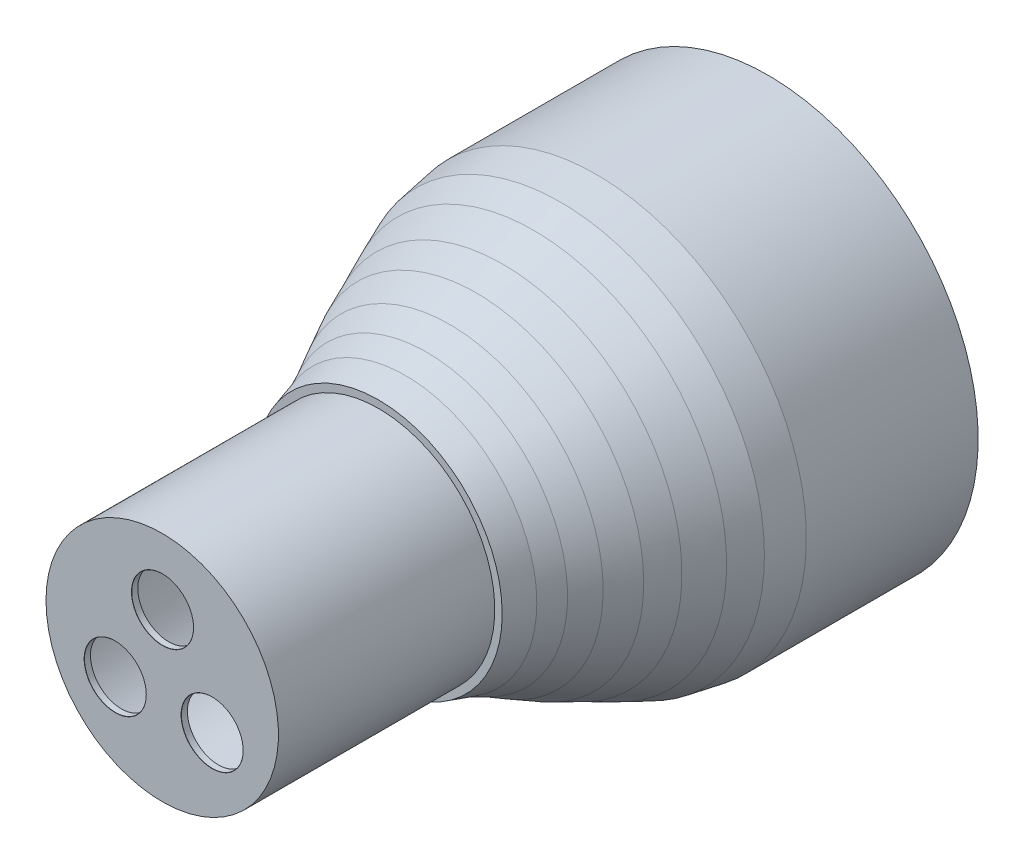
ISO-10303-21;
HEADER;
FILE_DESCRIPTION(('STEP AP214'),'2;1');
FILE_NAME('part.step','',(''),(''),'','','');
FILE_SCHEMA(('AUTOMOTIVE_DESIGN { 1 0 10303 214 1 1 1 1 }'));
ENDSEC;
DATA;
#1=APPLICATION_CONTEXT('core data for automotive mechanical design processes');
#2=APPLICATION_PROTOCOL_DEFINITION('international standard','automotive_design',2000,#1);
#3=PRODUCT_CONTEXT('',#1,'mechanical');
#4=PRODUCT('Part','Part','',(#3));
#5=PRODUCT_RELATED_PRODUCT_CATEGORY('part','',(#4));
#6=PRODUCT_DEFINITION_FORMATION('','',#4);
#7=PRODUCT_DEFINITION_CONTEXT('part definition',#1,'design');
#8=PRODUCT_DEFINITION('design','',#6,#7);
#9=PRODUCT_DEFINITION_SHAPE('','',#8);
#10=(LENGTH_UNIT() NAMED_UNIT(*) SI_UNIT(.MILLI.,.METRE.));
#11=(NAMED_UNIT(*) PLANE_ANGLE_UNIT() SI_UNIT($,.RADIAN.));
#12=(NAMED_UNIT(*) SI_UNIT($,.STERADIAN.) SOLID_ANGLE_UNIT());
#13=UNCERTAINTY_MEASURE_WITH_UNIT(LENGTH_MEASURE(1.E-05),#10,'distance_accuracy_value','');
#14=(GEOMETRIC_REPRESENTATION_CONTEXT(3) GLOBAL_UNCERTAINTY_ASSIGNED_CONTEXT((#13)) GLOBAL_UNIT_ASSIGNED_CONTEXT((#10,
#11,#12)) REPRESENTATION_CONTEXT('',''));
#15=CARTESIAN_POINT('',(0.,0.,0.));
#16=DIRECTION('',(0.,0.,1.));
#17=DIRECTION('',(1.,0.,0.));
#18=AXIS2_PLACEMENT_3D('',#15,#16,#17);
#19=CARTESIAN_POINT('',(-8.66903428879138,0.,-16.));
#20=DIRECTION('',(0.,0.,-1.));
#21=DIRECTION('',(-1.,0.,0.));
#22=AXIS2_PLACEMENT_3D('',#19,#20,#21);
#23=CYLINDRICAL_SURFACE('',#22,17.8);
#24=CARTESIAN_POINT('',(-8.66903428879138,0.,-50.));
#25=DIRECTION('',(0.,0.,-1.));
#26=DIRECTION('',(-1.,0.,0.));
#27=AXIS2_PLACEMENT_3D('',#24,#25,#26);
#28=CIRCLE('',#27,17.8);
#29=CARTESIAN_POINT('',(-26.4690342887914,0.,-50.));
#30=VERTEX_POINT('',#29);
#31=EDGE_CURVE('E10',#30,#30,#28,.T.);
#32=ORIENTED_EDGE('',*,*,#31,.T.);
#33=EDGE_LOOP('',(#32));
#34=FACE_BOUND('',#33,.T.);
#35=CARTESIAN_POINT('',(-8.66903428879138,0.,-16.));
#36=DIRECTION('',(0.,0.,-1.));
#37=DIRECTION('',(-1.,0.,0.));
#38=AXIS2_PLACEMENT_3D('',#35,#36,#37);
#39=CIRCLE('',#38,17.8);
#40=CARTESIAN_POINT('',(-26.4690342887914,0.,-16.));
#41=VERTEX_POINT('',#40);
#42=EDGE_CURVE('E52',#41,#41,#39,.T.);
#43=ORIENTED_EDGE('',*,*,#42,.F.);
#44=EDGE_LOOP('',(#43));
#45=FACE_BOUND('',#44,.T.);
#46=ADVANCED_FACE('F34',(#34,#45),#23,.F.);
#47=CARTESIAN_POINT('',(-8.66903428879138,0.,-50.));
#48=DIRECTION('',(0.,0.,-1.));
#49=DIRECTION('',(-1.,0.,0.));
#50=AXIS2_PLACEMENT_3D('',#47,#48,#49);
#51=CONICAL_SURFACE('',#50,17.8,0.157762707712365);
#52=CARTESIAN_POINT('',(-8.66903428879138,0.,-53.9341050667215));
#53=DIRECTION('',(0.,0.,-1.));
#54=DIRECTION('',(-1.,0.,0.));
#55=AXIS2_PLACEMENT_3D('',#52,#53,#54);
#56=CIRCLE('',#55,18.4258560289448);
#57=CARTESIAN_POINT('',(-27.0948903177362,0.,-53.9341050667215));
#58=VERTEX_POINT('',#57);
#59=EDGE_CURVE('E41',#58,#58,#56,.T.);
#60=ORIENTED_EDGE('',*,*,#59,.T.);
#61=EDGE_LOOP('',(#60));
#62=FACE_BOUND('',#61,.T.);
#63=ORIENTED_EDGE('',*,*,#31,.F.);
#64=EDGE_LOOP('',(#63));
#65=FACE_BOUND('',#64,.T.);
#66=ADVANCED_FACE('F140',(#62,#65),#51,.F.);
#67=CARTESIAN_POINT('',(-8.66903428879138,0.,-53.9341050667215));
#68=DIRECTION('',(0.,0.,-1.));
#69=DIRECTION('',(-1.,0.,0.));
#70=AXIS2_PLACEMENT_3D('',#67,#68,#69);
#71=CONICAL_SURFACE('',#70,18.4258560289448,0.484477929037022);
#72=CARTESIAN_POINT('',(-8.66903428879138,0.,-59.3263719334045));
#73=DIRECTION('',(0.,0.,-1.));
#74=DIRECTION('',(-1.,0.,0.));
#75=AXIS2_PLACEMENT_3D('',#72,#73,#74);
#76=CIRCLE('',#75,21.2638912219359);
#77=CARTESIAN_POINT('',(-29.9329255107273,0.,-59.3263719334045));
#78=VERTEX_POINT('',#77);
#79=EDGE_CURVE('E46',#78,#78,#76,.T.);
#80=ORIENTED_EDGE('',*,*,#79,.T.);
#81=EDGE_LOOP('',(#80));
#82=FACE_BOUND('',#81,.T.);
#83=ORIENTED_EDGE('',*,*,#59,.F.);
#84=EDGE_LOOP('',(#83));
#85=FACE_BOUND('',#84,.T.);
#86=ADVANCED_FACE('F125',(#82,#85),#71,.F.);
#87=CARTESIAN_POINT('',(-8.66903428879138,0.,-59.3263719334045));
#88=DIRECTION('',(0.,0.,-1.));
#89=DIRECTION('',(-1.,0.,0.));
#90=AXIS2_PLACEMENT_3D('',#87,#88,#89);
#91=CONICAL_SURFACE('',#90,21.2638912219359,0.568594158356578);
#92=CARTESIAN_POINT('',(-8.66903428879138,0.,-65.8116474496894));
#93=DIRECTION('',(0.,0.,-1.));
#94=DIRECTION('',(-1.,0.,0.));
#95=AXIS2_PLACEMENT_3D('',#92,#93,#94);
#96=CIRCLE('',#95,25.4078974330345);
#97=CARTESIAN_POINT('',(-34.0769317218259,0.,-65.8116474496894));
#98=VERTEX_POINT('',#97);
#99=EDGE_CURVE('E120',#98,#98,#96,.T.);
#100=ORIENTED_EDGE('',*,*,#99,.T.);
#101=EDGE_LOOP('',(#100));
#102=FACE_BOUND('',#101,.T.);
#103=ORIENTED_EDGE('',*,*,#79,.F.);
#104=EDGE_LOOP('',(#103));
#105=FACE_BOUND('',#104,.T.);
#106=ADVANCED_FACE('F128',(#102,#105),#91,.F.);
#107=CARTESIAN_POINT('',(-8.66903428879138,0.,-65.8116474496894));
#108=DIRECTION('',(0.,0.,-1.));
#109=DIRECTION('',(-1.,0.,0.));
#110=AXIS2_PLACEMENT_3D('',#107,#108,#109);
#111=CONICAL_SURFACE('',#110,25.4078974330345,0.414658083621896);
#112=CARTESIAN_POINT('',(-8.66903428879138,0.,-77.8398126003887));
#113=DIRECTION('',(0.,0.,-1.));
#114=DIRECTION('',(-1.,0.,0.));
#115=AXIS2_PLACEMENT_3D('',#112,#113,#114);
#116=CIRCLE('',#115,30.7024611244156);
#117=CARTESIAN_POINT('',(-39.371495413207,0.,-77.8398126003887));
#118=VERTEX_POINT('',#117);
#119=EDGE_CURVE('E117',#118,#118,#116,.T.);
#120=ORIENTED_EDGE('',*,*,#119,.T.);
#121=EDGE_LOOP('',(#120));
#122=FACE_BOUND('',#121,.T.);
#123=ORIENTED_EDGE('',*,*,#99,.F.);
#124=EDGE_LOOP('',(#123));
#125=FACE_BOUND('',#124,.T.);
#126=ADVANCED_FACE('F130',(#122,#125),#111,.F.);
#127=CARTESIAN_POINT('',(-8.66903428879138,0.,-77.8398126003887));
#128=DIRECTION('',(0.,0.,-1.));
#129=DIRECTION('',(-1.,0.,0.));
#130=AXIS2_PLACEMENT_3D('',#127,#128,#129);
#131=CONICAL_SURFACE('',#130,30.7024611244156,0.150406298673594);
#132=CARTESIAN_POINT('',(-8.66903428879138,0.,-93.));
#133=DIRECTION('',(0.,0.,-1.));
#134=DIRECTION('',(-1.,0.,0.));
#135=AXIS2_PLACEMENT_3D('',#132,#133,#134);
#136=CIRCLE('',#135,33.);
#137=CARTESIAN_POINT('',(-41.6690342887914,0.,-93.));
#138=VERTEX_POINT('',#137);
#139=EDGE_CURVE('E114',#138,#138,#136,.T.);
#140=ORIENTED_EDGE('',*,*,#139,.T.);
#141=EDGE_LOOP('',(#140));
#142=FACE_BOUND('',#141,.T.);
#143=ORIENTED_EDGE('',*,*,#119,.F.);
#144=EDGE_LOOP('',(#143));
#145=FACE_BOUND('',#144,.T.);
#146=ADVANCED_FACE('F137',(#142,#145),#131,.F.);
#147=CARTESIAN_POINT('',(-8.66903428879138,0.,-16.));
#148=DIRECTION('',(0.,0.,-1.));
#149=DIRECTION('',(-1.,0.,0.));
#150=AXIS2_PLACEMENT_3D('',#147,#148,#149);
#151=CYLINDRICAL_SURFACE('',#150,33.);
#152=CARTESIAN_POINT('',(-8.66903428879138,0.,-113.));
#153=DIRECTION('',(0.,0.,-1.));
#154=DIRECTION('',(-1.,0.,0.));
#155=AXIS2_PLACEMENT_3D('',#152,#153,#154);
#156=CIRCLE('',#155,33.);
#157=CARTESIAN_POINT('',(-41.6690342887914,0.,-113.));
#158=VERTEX_POINT('',#157);
#159=EDGE_CURVE('E111',#158,#158,#156,.T.);
#160=ORIENTED_EDGE('',*,*,#159,.T.);
#161=EDGE_LOOP('',(#160));
#162=FACE_BOUND('',#161,.T.);
#163=ORIENTED_EDGE('',*,*,#139,.F.);
#164=EDGE_LOOP('',(#163));
#165=FACE_BOUND('',#164,.T.);
#166=ADVANCED_FACE('F216',(#162,#165),#151,.F.);
#167=CARTESIAN_POINT('',(-42.6690342887914,0.,-113.));
#168=DIRECTION('',(0.,0.,-1.));
#169=DIRECTION('',(-1.,0.,0.));
#170=AXIS2_PLACEMENT_3D('',#167,#168,#169);
#171=PLANE('',#170);
#172=CARTESIAN_POINT('',(-8.66903428879138,0.,-113.));
#173=DIRECTION('',(0.,0.,-1.));
#174=DIRECTION('',(-1.,0.,0.));
#175=AXIS2_PLACEMENT_3D('',#172,#173,#174);
#176=CIRCLE('',#175,34.);
#177=CARTESIAN_POINT('',(-42.6690342887914,0.,-113.));
#178=VERTEX_POINT('',#177);
#179=EDGE_CURVE('E108',#178,#178,#176,.T.);
#180=ORIENTED_EDGE('',*,*,#179,.T.);
#181=EDGE_LOOP('',(#180));
#182=FACE_BOUND('',#181,.T.);
#183=ORIENTED_EDGE('',*,*,#159,.F.);
#184=EDGE_LOOP('',(#183));
#185=FACE_BOUND('',#184,.T.);
#186=ADVANCED_FACE('F212',(#182,#185),#171,.T.);
#187=CARTESIAN_POINT('',(-8.66903428879138,0.,-16.));
#188=DIRECTION('',(0.,0.,-1.));
#189=DIRECTION('',(-1.,0.,0.));
#190=AXIS2_PLACEMENT_3D('',#187,#188,#189);
#191=CYLINDRICAL_SURFACE('',#190,34.);
#192=CARTESIAN_POINT('',(-8.66903428879138,0.,-85.2088551823281));
#193=DIRECTION('',(0.,0.,-1.));
#194=DIRECTION('',(-1.,0.,0.));
#195=AXIS2_PLACEMENT_3D('',#192,#193,#194);
#196=CIRCLE('',#195,34.);
#197=CARTESIAN_POINT('',(-42.6690342887914,0.,-85.2088551823281));
#198=VERTEX_POINT('',#197);
#199=EDGE_CURVE('E105',#198,#198,#196,.T.);
#200=ORIENTED_EDGE('',*,*,#199,.T.);
#201=EDGE_LOOP('',(#200));
#202=FACE_BOUND('',#201,.T.);
#203=ORIENTED_EDGE('',*,*,#179,.F.);
#204=EDGE_LOOP('',(#203));
#205=FACE_BOUND('',#204,.T.);
#206=ADVANCED_FACE('F208',(#202,#205),#191,.T.);
#207=CARTESIAN_POINT('',(-8.66903428879138,0.,-85.2088551823281));
#208=DIRECTION('',(0.,0.,-1.));
#209=DIRECTION('',(-1.,0.,0.));
#210=AXIS2_PLACEMENT_3D('',#207,#208,#209);
#211=CONICAL_SURFACE('',#210,34.,0.171133999776557);
#212=CARTESIAN_POINT('',(-8.66903428879138,0.,-79.4226373320863));
#213=DIRECTION('',(0.,0.,-1.));
#214=DIRECTION('',(-1.,0.,0.));
#215=AXIS2_PLACEMENT_3D('',#212,#213,#214);
#216=CIRCLE('',#215,33.);
#217=CARTESIAN_POINT('',(-41.6690342887914,0.,-79.4226373320863));
#218=VERTEX_POINT('',#217);
#219=EDGE_CURVE('E102',#218,#218,#216,.T.);
#220=ORIENTED_EDGE('',*,*,#219,.T.);
#221=EDGE_LOOP('',(#220));
#222=FACE_BOUND('',#221,.T.);
#223=ORIENTED_EDGE('',*,*,#199,.F.);
#224=EDGE_LOOP('',(#223));
#225=FACE_BOUND('',#224,.T.);
#226=ADVANCED_FACE('F204',(#222,#225),#211,.T.);
#227=CARTESIAN_POINT('',(-8.66903428879138,0.,-79.4226373320863));
#228=DIRECTION('',(0.,0.,-1.));
#229=DIRECTION('',(-1.,0.,0.));
#230=AXIS2_PLACEMENT_3D('',#227,#228,#229);
#231=CONICAL_SURFACE('',#230,33.,0.397305922526933);
#232=CARTESIAN_POINT('',(-8.66903428879138,0.,-75.1171781672985));
#233=DIRECTION('',(0.,0.,-1.));
#234=DIRECTION('',(-1.,0.,0.));
#235=AXIS2_PLACEMENT_3D('',#232,#233,#234);
#236=CIRCLE('',#235,31.1933381910491);
#237=CARTESIAN_POINT('',(-39.8623724798404,0.,-75.1171781672985));
#238=VERTEX_POINT('',#237);
#239=EDGE_CURVE('E99',#238,#238,#236,.T.);
#240=ORIENTED_EDGE('',*,*,#239,.T.);
#241=EDGE_LOOP('',(#240));
#242=FACE_BOUND('',#241,.T.);
#243=ORIENTED_EDGE('',*,*,#219,.F.);
#244=EDGE_LOOP('',(#243));
#245=FACE_BOUND('',#244,.T.);
#246=ADVANCED_FACE('F200',(#242,#245),#231,.T.);
#247=CARTESIAN_POINT('',(-8.66903428879138,0.,-75.1171781672985));
#248=DIRECTION('',(0.,0.,-1.));
#249=DIRECTION('',(-1.,0.,0.));
#250=AXIS2_PLACEMENT_3D('',#247,#248,#249);
#251=CONICAL_SURFACE('',#250,31.1933381910491,0.422165715006541);
#252=CARTESIAN_POINT('',(-8.66903428879138,0.,-70.1224722289791));
#253=DIRECTION('',(0.,0.,-1.));
#254=DIRECTION('',(-1.,0.,0.));
#255=AXIS2_PLACEMENT_3D('',#252,#253,#254);
#256=CIRCLE('',#255,28.9498527279035);
#257=CARTESIAN_POINT('',(-37.6188870166949,0.,-70.1224722289791));
#258=VERTEX_POINT('',#257);
#259=EDGE_CURVE('E96',#258,#258,#256,.T.);
#260=ORIENTED_EDGE('',*,*,#259,.T.);
#261=EDGE_LOOP('',(#260));
#262=FACE_BOUND('',#261,.T.);
#263=ORIENTED_EDGE('',*,*,#239,.F.);
#264=EDGE_LOOP('',(#263));
#265=FACE_BOUND('',#264,.T.);
#266=ADVANCED_FACE('F196',(#262,#265),#251,.T.);
#267=CARTESIAN_POINT('',(-8.66903428879138,0.,-70.1224722289791));
#268=DIRECTION('',(0.,0.,-1.));
#269=DIRECTION('',(-1.,0.,0.));
#270=AXIS2_PLACEMENT_3D('',#267,#268,#269);
#271=CONICAL_SURFACE('',#270,28.9498527279035,0.408611682684209);
#272=CARTESIAN_POINT('',(-8.66903428879138,0.,-65.8116474496894));
#273=DIRECTION('',(0.,0.,-1.));
#274=DIRECTION('',(-1.,0.,0.));
#275=AXIS2_PLACEMENT_3D('',#272,#273,#274);
#276=CIRCLE('',#275,27.0833448206381);
#277=CARTESIAN_POINT('',(-35.7523791094295,0.,-65.8116474496894));
#278=VERTEX_POINT('',#277);
#279=EDGE_CURVE('E93',#278,#278,#276,.T.);
#280=ORIENTED_EDGE('',*,*,#279,.T.);
#281=EDGE_LOOP('',(#280));
#282=FACE_BOUND('',#281,.T.);
#283=ORIENTED_EDGE('',*,*,#259,.F.);
#284=EDGE_LOOP('',(#283));
#285=FACE_BOUND('',#284,.T.);
#286=ADVANCED_FACE('F192',(#282,#285),#271,.T.);
#287=CARTESIAN_POINT('',(-8.66903428879138,0.,-65.8116474496894));
#288=DIRECTION('',(0.,0.,-1.));
#289=DIRECTION('',(-1.,0.,0.));
#290=AXIS2_PLACEMENT_3D('',#287,#288,#289);
#291=CONICAL_SURFACE('',#290,27.0833448206381,0.483903001222864);
#292=CARTESIAN_POINT('',(-8.66903428879138,0.,-61.5062244965317));
#293=DIRECTION('',(0.,0.,-1.));
#294=DIRECTION('',(-1.,0.,0.));
#295=AXIS2_PLACEMENT_3D('',#292,#293,#294);
#296=CIRCLE('',#295,24.8204927723013);
#297=CARTESIAN_POINT('',(-33.4895270610927,0.,-61.5062244965317));
#298=VERTEX_POINT('',#297);
#299=EDGE_CURVE('E90',#298,#298,#296,.T.);
#300=ORIENTED_EDGE('',*,*,#299,.T.);
#301=EDGE_LOOP('',(#300));
#302=FACE_BOUND('',#301,.T.);
#303=ORIENTED_EDGE('',*,*,#279,.F.);
#304=EDGE_LOOP('',(#303));
#305=FACE_BOUND('',#304,.T.);
#306=ADVANCED_FACE('F188',(#302,#305),#291,.T.);
#307=CARTESIAN_POINT('',(-8.66903428879138,0.,-61.5062244965317));
#308=DIRECTION('',(0.,0.,-1.));
#309=DIRECTION('',(-1.,0.,0.));
#310=AXIS2_PLACEMENT_3D('',#307,#308,#309);
#311=CONICAL_SURFACE('',#310,24.8204927723013,0.496730737099159);
#312=CARTESIAN_POINT('',(-8.66903428879138,0.,-57.7775293227615));
#313=DIRECTION('',(0.,0.,-1.));
#314=DIRECTION('',(-1.,0.,0.));
#315=AXIS2_PLACEMENT_3D('',#312,#313,#314);
#316=CIRCLE('',#315,22.7992973242255);
#317=CARTESIAN_POINT('',(-31.4683316130169,0.,-57.7775293227615));
#318=VERTEX_POINT('',#317);
#319=EDGE_CURVE('E87',#318,#318,#316,.T.);
#320=ORIENTED_EDGE('',*,*,#319,.T.);
#321=EDGE_LOOP('',(#320));
#322=FACE_BOUND('',#321,.T.);
#323=ORIENTED_EDGE('',*,*,#299,.F.);
#324=EDGE_LOOP('',(#323));
#325=FACE_BOUND('',#324,.T.);
#326=ADVANCED_FACE('F184',(#322,#325),#311,.T.);
#327=CARTESIAN_POINT('',(-8.66903428879138,0.,-57.7775293227615));
#328=DIRECTION('',(0.,0.,-1.));
#329=DIRECTION('',(-1.,0.,0.));
#330=AXIS2_PLACEMENT_3D('',#327,#328,#329);
#331=CONICAL_SURFACE('',#330,22.7992973242255,0.419602754031826);
#332=CARTESIAN_POINT('',(-8.66903428879138,0.,-54.335656854666));
#333=DIRECTION('',(0.,0.,-1.));
#334=DIRECTION('',(-1.,0.,0.));
#335=AXIS2_PLACEMENT_3D('',#332,#333,#334);
#336=CIRCLE('',#335,21.2638912219359);
#337=CARTESIAN_POINT('',(-29.9329255107273,0.,-54.335656854666));
#338=VERTEX_POINT('',#337);
#339=EDGE_CURVE('E84',#338,#338,#336,.T.);
#340=ORIENTED_EDGE('',*,*,#339,.T.);
#341=EDGE_LOOP('',(#340));
#342=FACE_BOUND('',#341,.T.);
#343=ORIENTED_EDGE('',*,*,#319,.F.);
#344=EDGE_LOOP('',(#343));
#345=FACE_BOUND('',#344,.T.);
#346=ADVANCED_FACE('F180',(#342,#345),#331,.T.);
#347=CARTESIAN_POINT('',(-8.66903428879138,0.,-54.335656854666));
#348=DIRECTION('',(0.,0.,-1.));
#349=DIRECTION('',(-1.,0.,0.));
#350=AXIS2_PLACEMENT_3D('',#347,#348,#349);
#351=CONICAL_SURFACE('',#350,21.2638912219359,0.283650546542595);
#352=CARTESIAN_POINT('',(-8.66903428879138,0.,-50.));
#353=DIRECTION('',(0.,0.,-1.));
#354=DIRECTION('',(-1.,0.,0.));
#355=AXIS2_PLACEMENT_3D('',#352,#353,#354);
#356=CIRCLE('',#355,20.);
#357=CARTESIAN_POINT('',(-28.6690342887914,0.,-50.));
#358=VERTEX_POINT('',#357);
#359=EDGE_CURVE('E81',#358,#358,#356,.T.);
#360=ORIENTED_EDGE('',*,*,#359,.T.);
#361=EDGE_LOOP('',(#360));
#362=FACE_BOUND('',#361,.T.);
#363=ORIENTED_EDGE('',*,*,#339,.F.);
#364=EDGE_LOOP('',(#363));
#365=FACE_BOUND('',#364,.T.);
#366=ADVANCED_FACE('F176',(#362,#365),#351,.T.);
#367=CARTESIAN_POINT('',(-27.4690342887914,0.,-50.));
#368=DIRECTION('',(0.,0.,1.));
#369=DIRECTION('',(1.,0.,0.));
#370=AXIS2_PLACEMENT_3D('',#367,#368,#369);
#371=PLANE('',#370);
#372=CARTESIAN_POINT('',(-8.66903428879138,0.,-50.));
#373=DIRECTION('',(0.,0.,-1.));
#374=DIRECTION('',(-1.,0.,0.));
#375=AXIS2_PLACEMENT_3D('',#372,#373,#374);
#376=CIRCLE('',#375,18.8);
#377=CARTESIAN_POINT('',(-27.4690342887914,0.,-50.));
#378=VERTEX_POINT('',#377);
#379=EDGE_CURVE('E78',#378,#378,#376,.T.);
#380=ORIENTED_EDGE('',*,*,#379,.T.);
#381=EDGE_LOOP('',(#380));
#382=FACE_BOUND('',#381,.T.);
#383=ORIENTED_EDGE('',*,*,#359,.F.);
#384=EDGE_LOOP('',(#383));
#385=FACE_BOUND('',#384,.T.);
#386=ADVANCED_FACE('F172',(#382,#385),#371,.T.);
#387=CARTESIAN_POINT('',(-8.66903428879138,0.,-16.));
#388=DIRECTION('',(0.,0.,-1.));
#389=DIRECTION('',(-1.,0.,0.));
#390=AXIS2_PLACEMENT_3D('',#387,#388,#389);
#391=CYLINDRICAL_SURFACE('',#390,18.8);
#392=CARTESIAN_POINT('',(-8.66903428879138,0.,-15.));
#393=DIRECTION('',(0.,0.,-1.));
#394=DIRECTION('',(-1.,0.,0.));
#395=AXIS2_PLACEMENT_3D('',#392,#393,#394);
#396=CIRCLE('',#395,18.8);
#397=CARTESIAN_POINT('',(-27.4690342887914,0.,-15.));
#398=VERTEX_POINT('',#397);
#399=EDGE_CURVE('E75',#398,#398,#396,.T.);
#400=ORIENTED_EDGE('',*,*,#399,.T.);
#401=EDGE_LOOP('',(#400));
#402=FACE_BOUND('',#401,.T.);
#403=ORIENTED_EDGE('',*,*,#379,.F.);
#404=EDGE_LOOP('',(#403));
#405=FACE_BOUND('',#404,.T.);
#406=ADVANCED_FACE('F163',(#402,#405),#391,.T.);
#407=CARTESIAN_POINT('',(-27.4690342887914,0.,-15.));
#408=DIRECTION('',(0.,0.,1.));
#409=DIRECTION('',(1.,0.,0.));
#410=AXIS2_PLACEMENT_3D('',#407,#408,#409);
#411=PLANE('',#410);
#412=CARTESIAN_POINT('',(-8.62181151969285,8.12231628494735,-15.));
#413=DIRECTION('',(0.,0.,1.));
#414=DIRECTION('',(1.,0.,0.));
#415=AXIS2_PLACEMENT_3D('',#412,#413,#414);
#416=CIRCLE('',#415,5.025);
#417=CARTESIAN_POINT('',(-3.59681151969285,8.12231628494735,-15.));
#418=VERTEX_POINT('',#417);
#419=EDGE_CURVE('E356',#418,#418,#416,.T.);
#420=ORIENTED_EDGE('',*,*,#419,.F.);
#421=EDGE_LOOP('',(#420));
#422=FACE_BOUND('',#421,.T.);
#423=CARTESIAN_POINT('',(-16.2719001136546,-5.1000590626408,-15.));
#424=DIRECTION('',(0.,0.,1.));
#425=DIRECTION('',(1.,0.,0.));
#426=AXIS2_PLACEMENT_3D('',#423,#424,#425);
#427=CIRCLE('',#426,5.025);
#428=CARTESIAN_POINT('',(-11.2469001136546,-5.1000590626408,-15.));
#429=VERTEX_POINT('',#428);
#430=EDGE_CURVE('E63',#429,#429,#427,.T.);
#431=ORIENTED_EDGE('',*,*,#430,.F.);
#432=EDGE_LOOP('',(#431));
#433=FACE_BOUND('',#432,.T.);
#434=CARTESIAN_POINT('',(-0.593940772942905,-5.1000590626408,-15.));
#435=DIRECTION('',(0.,0.,1.));
#436=DIRECTION('',(1.,0.,0.));
#437=AXIS2_PLACEMENT_3D('',#434,#435,#436);
#438=CIRCLE('',#437,5.025);
#439=CARTESIAN_POINT('',(4.4310592270571,-5.1000590626408,-15.));
#440=VERTEX_POINT('',#439);
#441=EDGE_CURVE('E56',#440,#440,#438,.T.);
#442=ORIENTED_EDGE('',*,*,#441,.F.);
#443=EDGE_LOOP('',(#442));
#444=FACE_BOUND('',#443,.T.);
#445=ORIENTED_EDGE('',*,*,#399,.F.);
#446=EDGE_LOOP('',(#445));
#447=FACE_BOUND('',#446,.T.);
#448=ADVANCED_FACE('F153',(#422,#433,#444,#447),#411,.T.);
#449=CARTESIAN_POINT('',(-26.4690342887914,0.,-16.));
#450=DIRECTION('',(0.,0.,-1.));
#451=DIRECTION('',(-1.,0.,0.));
#452=AXIS2_PLACEMENT_3D('',#449,#450,#451);
#453=PLANE('',#452);
#454=CARTESIAN_POINT('',(-8.62181151969285,8.12231628494735,-16.));
#455=DIRECTION('',(0.,0.,-1.));
#456=DIRECTION('',(-1.,0.,0.));
#457=AXIS2_PLACEMENT_3D('',#454,#455,#456);
#458=CIRCLE('',#457,4.99999999999999);
#459=CARTESIAN_POINT('',(-13.6218115196928,8.12231628494735,-16.));
#460=VERTEX_POINT('',#459);
#461=EDGE_CURVE('E37',#460,#460,#458,.T.);
#462=ORIENTED_EDGE('',*,*,#461,.F.);
#463=EDGE_LOOP('',(#462));
#464=FACE_BOUND('',#463,.T.);
#465=CARTESIAN_POINT('',(-16.2719001136546,-5.1000590626408,-16.));
#466=DIRECTION('',(0.,0.,-1.));
#467=DIRECTION('',(-1.,0.,0.));
#468=AXIS2_PLACEMENT_3D('',#465,#466,#467);
#469=CIRCLE('',#468,4.99999999999999);
#470=CARTESIAN_POINT('',(-21.2719001136546,-5.1000590626408,-16.));
#471=VERTEX_POINT('',#470);
#472=EDGE_CURVE('E54',#471,#471,#469,.T.);
#473=ORIENTED_EDGE('',*,*,#472,.F.);
#474=EDGE_LOOP('',(#473));
#475=FACE_BOUND('',#474,.T.);
#476=CARTESIAN_POINT('',(-0.593940772942905,-5.1000590626408,-16.));
#477=DIRECTION('',(0.,0.,-1.));
#478=DIRECTION('',(-1.,0.,0.));
#479=AXIS2_PLACEMENT_3D('',#476,#477,#478);
#480=CIRCLE('',#479,4.99999999999999);
#481=CARTESIAN_POINT('',(-5.5939407729429,-5.1000590626408,-16.));
#482=VERTEX_POINT('',#481);
#483=EDGE_CURVE('E50',#482,#482,#480,.T.);
#484=ORIENTED_EDGE('',*,*,#483,.F.);
#485=EDGE_LOOP('',(#484));
#486=FACE_BOUND('',#485,.T.);
#487=ORIENTED_EDGE('',*,*,#42,.T.);
#488=EDGE_LOOP('',(#487));
#489=FACE_BOUND('',#488,.T.);
#490=ADVANCED_FACE('F150',(#464,#475,#486,#489),#453,.T.);
#491=CARTESIAN_POINT('',(-0.593940772942905,-5.1000590626408,-15.));
#492=DIRECTION('',(0.,0.,1.));
#493=DIRECTION('',(1.,0.,0.));
#494=AXIS2_PLACEMENT_3D('',#491,#492,#493);
#495=CYLINDRICAL_SURFACE('',#494,4.99999999999999);
#496=ORIENTED_EDGE('',*,*,#483,.T.);
#497=EDGE_LOOP('',(#496));
#498=FACE_BOUND('',#497,.T.);
#499=CARTESIAN_POINT('',(-0.593940772942905,-5.1000590626408,-15.025));
#500=DIRECTION('',(0.,0.,1.));
#501=DIRECTION('',(1.,0.,0.));
#502=AXIS2_PLACEMENT_3D('',#499,#500,#501);
#503=CIRCLE('',#502,5.);
#504=CARTESIAN_POINT('',(4.40605922705709,-5.1000590626408,-15.025));
#505=VERTEX_POINT('',#504);
#506=EDGE_CURVE('E53',#505,#505,#503,.T.);
#507=ORIENTED_EDGE('',*,*,#506,.T.);
#508=EDGE_LOOP('',(#507));
#509=FACE_BOUND('',#508,.T.);
#510=ADVANCED_FACE('F152',(#498,#509),#495,.F.);
#511=CARTESIAN_POINT('',(-0.593940772942905,-5.1000590626408,-15.));
#512=DIRECTION('',(0.,0.,1.));
#513=DIRECTION('',(1.,0.,0.));
#514=AXIS2_PLACEMENT_3D('',#511,#512,#513);
#515=CONICAL_SURFACE('',#514,5.025,0.785398163397396);
#516=ORIENTED_EDGE('',*,*,#506,.F.);
#517=EDGE_LOOP('',(#516));
#518=FACE_BOUND('',#517,.T.);
#519=ORIENTED_EDGE('',*,*,#441,.T.);
#520=EDGE_LOOP('',(#519));
#521=FACE_BOUND('',#520,.T.);
#522=ADVANCED_FACE('F160',(#518,#521),#515,.F.);
#523=CARTESIAN_POINT('',(-16.2719001136546,-5.1000590626408,-15.));
#524=DIRECTION('',(0.,0.,1.));
#525=DIRECTION('',(1.,0.,0.));
#526=AXIS2_PLACEMENT_3D('',#523,#524,#525);
#527=CYLINDRICAL_SURFACE('',#526,4.99999999999999);
#528=ORIENTED_EDGE('',*,*,#472,.T.);
#529=EDGE_LOOP('',(#528));
#530=FACE_BOUND('',#529,.T.);
#531=CARTESIAN_POINT('',(-16.2719001136546,-5.1000590626408,-15.025));
#532=DIRECTION('',(0.,0.,1.));
#533=DIRECTION('',(1.,0.,0.));
#534=AXIS2_PLACEMENT_3D('',#531,#532,#533);
#535=CIRCLE('',#534,5.);
#536=CARTESIAN_POINT('',(-11.2719001136546,-5.1000590626408,-15.025));
#537=VERTEX_POINT('',#536);
#538=EDGE_CURVE('E57',#537,#537,#535,.T.);
#539=ORIENTED_EDGE('',*,*,#538,.T.);
#540=EDGE_LOOP('',(#539));
#541=FACE_BOUND('',#540,.T.);
#542=ADVANCED_FACE('F308',(#530,#541),#527,.F.);
#543=CARTESIAN_POINT('',(-16.2719001136546,-5.1000590626408,-15.));
#544=DIRECTION('',(0.,0.,1.));
#545=DIRECTION('',(1.,0.,0.));
#546=AXIS2_PLACEMENT_3D('',#543,#544,#545);
#547=CONICAL_SURFACE('',#546,5.025,0.785398163397379);
#548=ORIENTED_EDGE('',*,*,#538,.F.);
#549=EDGE_LOOP('',(#548));
#550=FACE_BOUND('',#549,.T.);
#551=ORIENTED_EDGE('',*,*,#430,.T.);
#552=EDGE_LOOP('',(#551));
#553=FACE_BOUND('',#552,.T.);
#554=ADVANCED_FACE('F317',(#550,#553),#547,.F.);
#555=CARTESIAN_POINT('',(-8.62181151969285,8.12231628494735,-15.));
#556=DIRECTION('',(0.,0.,1.));
#557=DIRECTION('',(1.,0.,0.));
#558=AXIS2_PLACEMENT_3D('',#555,#556,#557);
#559=CYLINDRICAL_SURFACE('',#558,4.99999999999999);
#560=ORIENTED_EDGE('',*,*,#461,.T.);
#561=EDGE_LOOP('',(#560));
#562=FACE_BOUND('',#561,.T.);
#563=CARTESIAN_POINT('',(-8.62181151969285,8.12231628494735,-15.025));
#564=DIRECTION('',(0.,0.,1.));
#565=DIRECTION('',(1.,0.,0.));
#566=AXIS2_PLACEMENT_3D('',#563,#564,#565);
#567=CIRCLE('',#566,5.);
#568=CARTESIAN_POINT('',(-3.62181151969285,8.12231628494735,-15.025));
#569=VERTEX_POINT('',#568);
#570=EDGE_CURVE('E353',#569,#569,#567,.T.);
#571=ORIENTED_EDGE('',*,*,#570,.T.);
#572=EDGE_LOOP('',(#571));
#573=FACE_BOUND('',#572,.T.);
#574=ADVANCED_FACE('F326',(#562,#573),#559,.F.);
#575=CARTESIAN_POINT('',(-8.62181151969285,8.12231628494735,-15.));
#576=DIRECTION('',(0.,0.,1.));
#577=DIRECTION('',(1.,0.,0.));
#578=AXIS2_PLACEMENT_3D('',#575,#576,#577);
#579=CONICAL_SURFACE('',#578,5.025,0.785398163397396);
#580=ORIENTED_EDGE('',*,*,#570,.F.);
#581=EDGE_LOOP('',(#580));
#582=FACE_BOUND('',#581,.T.);
#583=ORIENTED_EDGE('',*,*,#419,.T.);
#584=EDGE_LOOP('',(#583));
#585=FACE_BOUND('',#584,.T.);
#586=ADVANCED_FACE('F336',(#582,#585),#579,.F.);
#587=CLOSED_SHELL('',(#46,#66,#86,#106,#126,#146,#166,#186,#206,#226,#246,#266,#286,#306,#326,
#346,#366,#386,#406,#448,#490,#510,#522,#542,#554,#574,#586));
#588=MANIFOLD_SOLID_BREP('B2',#587);
#589=ADVANCED_BREP_SHAPE_REPRESENTATION('',(#18,#588),#14);
#590=SHAPE_DEFINITION_REPRESENTATION(#9,#589);
ENDSEC;
END-ISO-10303-21;
